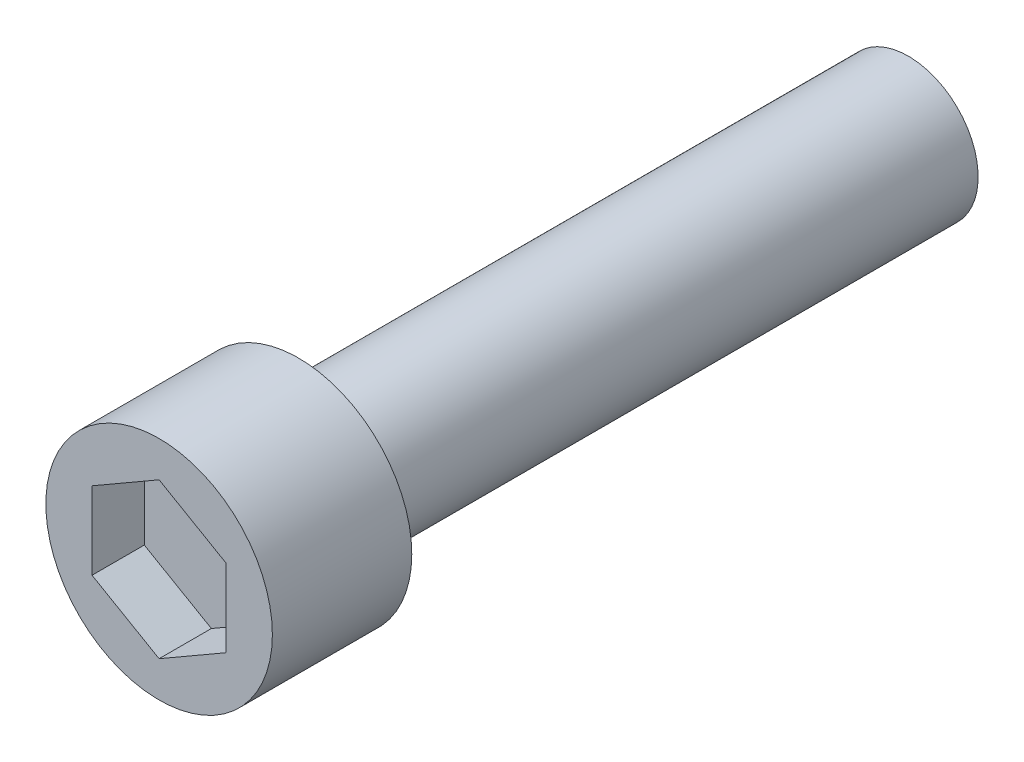
ISO-10303-21;
HEADER;
FILE_DESCRIPTION(('STEP AP214'),'2;1');
FILE_NAME('part.step','',(''),(''),'','','');
FILE_SCHEMA(('AUTOMOTIVE_DESIGN { 1 0 10303 214 1 1 1 1 }'));
ENDSEC;
DATA;
#1=APPLICATION_CONTEXT('core data for automotive mechanical design processes');
#2=APPLICATION_PROTOCOL_DEFINITION('international standard','automotive_design',2000,#1);
#3=PRODUCT_CONTEXT('',#1,'mechanical');
#4=PRODUCT('Part','Part','',(#3));
#5=PRODUCT_RELATED_PRODUCT_CATEGORY('part','',(#4));
#6=PRODUCT_DEFINITION_FORMATION('','',#4);
#7=PRODUCT_DEFINITION_CONTEXT('part definition',#1,'design');
#8=PRODUCT_DEFINITION('design','',#6,#7);
#9=PRODUCT_DEFINITION_SHAPE('','',#8);
#10=(LENGTH_UNIT() NAMED_UNIT(*) SI_UNIT(.MILLI.,.METRE.));
#11=(NAMED_UNIT(*) PLANE_ANGLE_UNIT() SI_UNIT($,.RADIAN.));
#12=(NAMED_UNIT(*) SI_UNIT($,.STERADIAN.) SOLID_ANGLE_UNIT());
#13=UNCERTAINTY_MEASURE_WITH_UNIT(LENGTH_MEASURE(1.E-05),#10,'distance_accuracy_value','');
#14=(GEOMETRIC_REPRESENTATION_CONTEXT(3) GLOBAL_UNCERTAINTY_ASSIGNED_CONTEXT((#13)) GLOBAL_UNIT_ASSIGNED_CONTEXT((#10,
#11,#12)) REPRESENTATION_CONTEXT('',''));
#15=CARTESIAN_POINT('',(0.,0.,0.));
#16=DIRECTION('',(0.,0.,1.));
#17=DIRECTION('',(1.,0.,0.));
#18=AXIS2_PLACEMENT_3D('',#15,#16,#17);
#19=CARTESIAN_POINT('',(0.,0.,5.));
#20=DIRECTION('',(0.,0.,1.));
#21=DIRECTION('',(1.,0.,0.));
#22=AXIS2_PLACEMENT_3D('',#19,#20,#21);
#23=PLANE('',#22);
#24=DIRECTION('',(0.866025403784439,0.5,0.));
#25=VECTOR('',#24,1.);
#26=CARTESIAN_POINT('',(3.84943360782227,-2.22247152970378,5.));
#27=LINE('',#26,#25);
#28=CARTESIAN_POINT('',(0.,-4.44494305940756,5.));
#29=VERTEX_POINT('',#28);
#30=CARTESIAN_POINT('',(3.84943360782227,-2.22247152970378,5.));
#31=VERTEX_POINT('',#30);
#32=EDGE_CURVE('E135',#29,#31,#27,.T.);
#33=ORIENTED_EDGE('',*,*,#32,.T.);
#34=DIRECTION('',(0.,1.,0.));
#35=VECTOR('',#34,1.);
#36=CARTESIAN_POINT('',(3.84943360782227,2.22247152970378,5.));
#37=LINE('',#36,#35);
#38=CARTESIAN_POINT('',(3.84943360782227,2.22247152970378,5.));
#39=VERTEX_POINT('',#38);
#40=EDGE_CURVE('E67',#31,#39,#37,.T.);
#41=ORIENTED_EDGE('',*,*,#40,.T.);
#42=DIRECTION('',(-0.866025403784439,0.5,0.));
#43=VECTOR('',#42,1.);
#44=CARTESIAN_POINT('',(0.,4.44494305940756,5.));
#45=LINE('',#44,#43);
#46=CARTESIAN_POINT('',(0.,4.44494305940756,5.));
#47=VERTEX_POINT('',#46);
#48=EDGE_CURVE('E69',#39,#47,#45,.T.);
#49=ORIENTED_EDGE('',*,*,#48,.T.);
#50=DIRECTION('',(-0.866025403784438,-0.5,0.));
#51=VECTOR('',#50,1.);
#52=CARTESIAN_POINT('',(-3.84943360782227,2.22247152970378,5.));
#53=LINE('',#52,#51);
#54=CARTESIAN_POINT('',(-3.84943360782227,2.22247152970378,5.));
#55=VERTEX_POINT('',#54);
#56=EDGE_CURVE('E71',#47,#55,#53,.T.);
#57=ORIENTED_EDGE('',*,*,#56,.T.);
#58=DIRECTION('',(0.,-1.,0.));
#59=VECTOR('',#58,1.);
#60=CARTESIAN_POINT('',(-3.84943360782227,-2.22247152970378,5.));
#61=LINE('',#60,#59);
#62=CARTESIAN_POINT('',(-3.84943360782227,-2.22247152970378,5.));
#63=VERTEX_POINT('',#62);
#64=EDGE_CURVE('E126',#55,#63,#61,.T.);
#65=ORIENTED_EDGE('',*,*,#64,.T.);
#66=DIRECTION('',(0.866025403784439,-0.5,0.));
#67=VECTOR('',#66,1.);
#68=CARTESIAN_POINT('',(0.,-4.44494305940756,5.));
#69=LINE('',#68,#67);
#70=EDGE_CURVE('E131',#63,#29,#69,.T.);
#71=ORIENTED_EDGE('',*,*,#70,.T.);
#72=EDGE_LOOP('',(#33,#41,#49,#57,#65,#71));
#73=FACE_BOUND('',#72,.T.);
#74=ADVANCED_FACE('F16',(#73),#23,.T.);
#75=CARTESIAN_POINT('',(-3.84943360782227,2.22247152970378,8.));
#76=DIRECTION('',(-0.5,0.866025403784438,0.));
#77=DIRECTION('',(-0.866025403784438,-0.5,0.));
#78=AXIS2_PLACEMENT_3D('',#75,#76,#77);
#79=PLANE('',#78);
#80=DIRECTION('',(0.,0.,1.));
#81=VECTOR('',#80,1.);
#82=CARTESIAN_POINT('',(-3.84943360782227,2.22247152970378,8.));
#83=LINE('',#82,#81);
#84=CARTESIAN_POINT('',(-3.84943360782227,2.22247152970378,8.));
#85=VERTEX_POINT('',#84);
#86=EDGE_CURVE('E82',#85,#55,#83,.F.);
#87=ORIENTED_EDGE('',*,*,#86,.T.);
#88=ORIENTED_EDGE('',*,*,#56,.F.);
#89=DIRECTION('',(0.,0.,1.));
#90=VECTOR('',#89,1.);
#91=CARTESIAN_POINT('',(0.,4.44494305940756,8.));
#92=LINE('',#91,#90);
#93=CARTESIAN_POINT('',(0.,4.44494305940756,8.));
#94=VERTEX_POINT('',#93);
#95=EDGE_CURVE('E76',#47,#94,#92,.T.);
#96=ORIENTED_EDGE('',*,*,#95,.T.);
#97=DIRECTION('',(0.866025403784439,0.5,0.));
#98=VECTOR('',#97,1.);
#99=CARTESIAN_POINT('',(-3.84943360782227,2.22247152970378,8.));
#100=LINE('',#99,#98);
#101=EDGE_CURVE('E123',#85,#94,#100,.T.);
#102=ORIENTED_EDGE('',*,*,#101,.F.);
#103=EDGE_LOOP('',(#87,#88,#96,#102));
#104=FACE_BOUND('',#103,.T.);
#105=ADVANCED_FACE('F79',(#104),#79,.F.);
#106=CARTESIAN_POINT('',(0.,4.44494305940756,8.));
#107=DIRECTION('',(0.5,0.866025403784439,0.));
#108=DIRECTION('',(-0.866025403784439,0.5,0.));
#109=AXIS2_PLACEMENT_3D('',#106,#107,#108);
#110=PLANE('',#109);
#111=ORIENTED_EDGE('',*,*,#95,.F.);
#112=ORIENTED_EDGE('',*,*,#48,.F.);
#113=DIRECTION('',(0.,0.,1.));
#114=VECTOR('',#113,1.);
#115=CARTESIAN_POINT('',(3.84943360782227,2.22247152970378,8.));
#116=LINE('',#115,#114);
#117=CARTESIAN_POINT('',(3.84943360782227,2.22247152970378,8.));
#118=VERTEX_POINT('',#117);
#119=EDGE_CURVE('E90',#39,#118,#116,.T.);
#120=ORIENTED_EDGE('',*,*,#119,.T.);
#121=DIRECTION('',(0.866025403784439,-0.5,0.));
#122=VECTOR('',#121,1.);
#123=CARTESIAN_POINT('',(0.,4.44494305940756,8.));
#124=LINE('',#123,#122);
#125=EDGE_CURVE('E87',#94,#118,#124,.T.);
#126=ORIENTED_EDGE('',*,*,#125,.F.);
#127=EDGE_LOOP('',(#111,#112,#120,#126));
#128=FACE_BOUND('',#127,.T.);
#129=ADVANCED_FACE('F85',(#128),#110,.F.);
#130=CARTESIAN_POINT('',(3.84943360782227,2.22247152970378,8.));
#131=DIRECTION('',(1.,0.,0.));
#132=DIRECTION('',(0.,1.,0.));
#133=AXIS2_PLACEMENT_3D('',#130,#131,#132);
#134=PLANE('',#133);
#135=ORIENTED_EDGE('',*,*,#119,.F.);
#136=ORIENTED_EDGE('',*,*,#40,.F.);
#137=DIRECTION('',(0.,0.,1.));
#138=VECTOR('',#137,1.);
#139=CARTESIAN_POINT('',(3.84943360782227,-2.22247152970378,8.));
#140=LINE('',#139,#138);
#141=CARTESIAN_POINT('',(3.84943360782227,-2.22247152970378,8.));
#142=VERTEX_POINT('',#141);
#143=EDGE_CURVE('E133',#31,#142,#140,.T.);
#144=ORIENTED_EDGE('',*,*,#143,.T.);
#145=DIRECTION('',(0.,1.,0.));
#146=VECTOR('',#145,1.);
#147=CARTESIAN_POINT('',(3.84943360782227,0.,8.));
#148=LINE('',#147,#146);
#149=EDGE_CURVE('E119',#118,#142,#148,.F.);
#150=ORIENTED_EDGE('',*,*,#149,.F.);
#151=EDGE_LOOP('',(#135,#136,#144,#150));
#152=FACE_BOUND('',#151,.T.);
#153=ADVANCED_FACE('F138',(#152),#134,.F.);
#154=CARTESIAN_POINT('',(3.84943360782227,-2.22247152970378,8.));
#155=DIRECTION('',(0.5,-0.866025403784439,0.));
#156=DIRECTION('',(0.866025403784439,0.5,0.));
#157=AXIS2_PLACEMENT_3D('',#154,#155,#156);
#158=PLANE('',#157);
#159=ORIENTED_EDGE('',*,*,#143,.F.);
#160=ORIENTED_EDGE('',*,*,#32,.F.);
#161=DIRECTION('',(0.,0.,1.));
#162=VECTOR('',#161,1.);
#163=CARTESIAN_POINT('',(0.,-4.44494305940756,8.));
#164=LINE('',#163,#162);
#165=CARTESIAN_POINT('',(0.,-4.44494305940756,8.));
#166=VERTEX_POINT('',#165);
#167=EDGE_CURVE('E129',#29,#166,#164,.T.);
#168=ORIENTED_EDGE('',*,*,#167,.T.);
#169=DIRECTION('',(-0.866025403784439,-0.5,0.));
#170=VECTOR('',#169,1.);
#171=CARTESIAN_POINT('',(3.84943360782227,-2.22247152970378,8.));
#172=LINE('',#171,#170);
#173=EDGE_CURVE('E114',#142,#166,#172,.T.);
#174=ORIENTED_EDGE('',*,*,#173,.F.);
#175=EDGE_LOOP('',(#159,#160,#168,#174));
#176=FACE_BOUND('',#175,.T.);
#177=ADVANCED_FACE('F149',(#176),#158,.F.);
#178=CARTESIAN_POINT('',(0.,-4.44494305940756,8.));
#179=DIRECTION('',(-0.5,-0.866025403784439,0.));
#180=DIRECTION('',(0.866025403784439,-0.5,0.));
#181=AXIS2_PLACEMENT_3D('',#178,#179,#180);
#182=PLANE('',#181);
#183=ORIENTED_EDGE('',*,*,#167,.F.);
#184=ORIENTED_EDGE('',*,*,#70,.F.);
#185=DIRECTION('',(0.,0.,1.));
#186=VECTOR('',#185,1.);
#187=CARTESIAN_POINT('',(-3.84943360782227,-2.22247152970378,8.));
#188=LINE('',#187,#186);
#189=CARTESIAN_POINT('',(-3.84943360782227,-2.22247152970378,8.));
#190=VERTEX_POINT('',#189);
#191=EDGE_CURVE('E34',#63,#190,#188,.T.);
#192=ORIENTED_EDGE('',*,*,#191,.T.);
#193=DIRECTION('',(-0.866025403784439,0.5,0.));
#194=VECTOR('',#193,1.);
#195=CARTESIAN_POINT('',(0.,-4.44494305940756,8.));
#196=LINE('',#195,#194);
#197=EDGE_CURVE('E110',#166,#190,#196,.T.);
#198=ORIENTED_EDGE('',*,*,#197,.F.);
#199=EDGE_LOOP('',(#183,#184,#192,#198));
#200=FACE_BOUND('',#199,.T.);
#201=ADVANCED_FACE('F147',(#200),#182,.F.);
#202=CARTESIAN_POINT('',(-3.84943360782227,-2.22247152970378,8.));
#203=DIRECTION('',(-1.,0.,0.));
#204=DIRECTION('',(0.,-1.,0.));
#205=AXIS2_PLACEMENT_3D('',#202,#203,#204);
#206=PLANE('',#205);
#207=ORIENTED_EDGE('',*,*,#191,.F.);
#208=ORIENTED_EDGE('',*,*,#64,.F.);
#209=ORIENTED_EDGE('',*,*,#86,.F.);
#210=DIRECTION('',(0.,1.,0.));
#211=VECTOR('',#210,1.);
#212=CARTESIAN_POINT('',(-3.84943360782227,0.,8.));
#213=LINE('',#212,#211);
#214=EDGE_CURVE('E106',#190,#85,#213,.T.);
#215=ORIENTED_EDGE('',*,*,#214,.F.);
#216=EDGE_LOOP('',(#207,#208,#209,#215));
#217=FACE_BOUND('',#216,.T.);
#218=ADVANCED_FACE('F144',(#217),#206,.F.);
#219=CARTESIAN_POINT('',(0.,0.,8.));
#220=DIRECTION('',(0.,0.,1.));
#221=DIRECTION('',(1.,0.,0.));
#222=AXIS2_PLACEMENT_3D('',#219,#220,#221);
#223=PLANE('',#222);
#224=ORIENTED_EDGE('',*,*,#197,.T.);
#225=ORIENTED_EDGE('',*,*,#214,.T.);
#226=ORIENTED_EDGE('',*,*,#101,.T.);
#227=ORIENTED_EDGE('',*,*,#125,.T.);
#228=ORIENTED_EDGE('',*,*,#149,.T.);
#229=ORIENTED_EDGE('',*,*,#173,.T.);
#230=EDGE_LOOP('',(#224,#225,#226,#227,#228,#229));
#231=FACE_BOUND('',#230,.T.);
#232=CARTESIAN_POINT('',(0.,0.,8.));
#233=DIRECTION('',(0.,0.,1.));
#234=DIRECTION('',(1.,0.,0.));
#235=AXIS2_PLACEMENT_3D('',#232,#233,#234);
#236=CIRCLE('',#235,6.5);
#237=CARTESIAN_POINT('',(6.5,0.,8.));
#238=VERTEX_POINT('',#237);
#239=EDGE_CURVE('E103',#238,#238,#236,.F.);
#240=ORIENTED_EDGE('',*,*,#239,.F.);
#241=EDGE_LOOP('',(#240));
#242=FACE_BOUND('',#241,.T.);
#243=ADVANCED_FACE('F141',(#231,#242),#223,.T.);
#244=CARTESIAN_POINT('',(0.,0.,0.));
#245=DIRECTION('',(0.,0.,1.));
#246=DIRECTION('',(1.,0.,0.));
#247=AXIS2_PLACEMENT_3D('',#244,#245,#246);
#248=CYLINDRICAL_SURFACE('',#247,6.5);
#249=CARTESIAN_POINT('',(0.,0.,0.));
#250=DIRECTION('',(0.,0.,1.));
#251=DIRECTION('',(1.,0.,0.));
#252=AXIS2_PLACEMENT_3D('',#249,#250,#251);
#253=CIRCLE('',#252,6.5);
#254=CARTESIAN_POINT('',(6.5,0.,0.));
#255=VERTEX_POINT('',#254);
#256=EDGE_CURVE('E98',#255,#255,#253,.T.);
#257=ORIENTED_EDGE('',*,*,#256,.T.);
#258=EDGE_LOOP('',(#257));
#259=FACE_BOUND('',#258,.T.);
#260=ORIENTED_EDGE('',*,*,#239,.T.);
#261=EDGE_LOOP('',(#260));
#262=FACE_BOUND('',#261,.T.);
#263=ADVANCED_FACE('F174',(#259,#262),#248,.T.);
#264=CARTESIAN_POINT('',(0.,0.,-35.));
#265=DIRECTION('',(0.,0.,1.));
#266=DIRECTION('',(1.,0.,0.));
#267=AXIS2_PLACEMENT_3D('',#264,#265,#266);
#268=PLANE('',#267);
#269=CARTESIAN_POINT('',(0.,0.,-35.));
#270=DIRECTION('',(0.,0.,-1.));
#271=DIRECTION('',(-1.,0.,0.));
#272=AXIS2_PLACEMENT_3D('',#269,#270,#271);
#273=CIRCLE('',#272,4.);
#274=CARTESIAN_POINT('',(-4.,0.,-35.));
#275=VERTEX_POINT('',#274);
#276=EDGE_CURVE('E25',#275,#275,#273,.F.);
#277=ORIENTED_EDGE('',*,*,#276,.F.);
#278=EDGE_LOOP('',(#277));
#279=FACE_BOUND('',#278,.T.);
#280=ADVANCED_FACE('F167',(#279),#268,.F.);
#281=CARTESIAN_POINT('',(0.,0.,0.));
#282=DIRECTION('',(0.,0.,1.));
#283=DIRECTION('',(1.,0.,0.));
#284=AXIS2_PLACEMENT_3D('',#281,#282,#283);
#285=PLANE('',#284);
#286=CARTESIAN_POINT('',(0.,0.,0.));
#287=DIRECTION('',(0.,0.,-1.));
#288=DIRECTION('',(-1.,0.,0.));
#289=AXIS2_PLACEMENT_3D('',#286,#287,#288);
#290=CIRCLE('',#289,4.);
#291=CARTESIAN_POINT('',(-4.,0.,0.));
#292=VERTEX_POINT('',#291);
#293=EDGE_CURVE('E11',#292,#292,#290,.T.);
#294=ORIENTED_EDGE('',*,*,#293,.F.);
#295=EDGE_LOOP('',(#294));
#296=FACE_BOUND('',#295,.T.);
#297=ORIENTED_EDGE('',*,*,#256,.F.);
#298=EDGE_LOOP('',(#297));
#299=FACE_BOUND('',#298,.T.);
#300=ADVANCED_FACE('F161',(#296,#299),#285,.F.);
#301=CARTESIAN_POINT('',(0.,0.,0.));
#302=DIRECTION('',(0.,0.,-1.));
#303=DIRECTION('',(-1.,0.,0.));
#304=AXIS2_PLACEMENT_3D('',#301,#302,#303);
#305=CYLINDRICAL_SURFACE('',#304,4.);
#306=ORIENTED_EDGE('',*,*,#293,.T.);
#307=EDGE_LOOP('',(#306));
#308=FACE_BOUND('',#307,.T.);
#309=ORIENTED_EDGE('',*,*,#276,.T.);
#310=EDGE_LOOP('',(#309));
#311=FACE_BOUND('',#310,.T.);
#312=ADVANCED_FACE('F159',(#308,#311),#305,.T.);
#313=CLOSED_SHELL('',(#74,#105,#129,#153,#177,#201,#218,#243,#263,#280,#300,#312));
#314=MANIFOLD_SOLID_BREP('B1',#313);
#315=ADVANCED_BREP_SHAPE_REPRESENTATION('',(#18,#314),#14);
#316=SHAPE_DEFINITION_REPRESENTATION(#9,#315);
ENDSEC;
END-ISO-10303-21;
